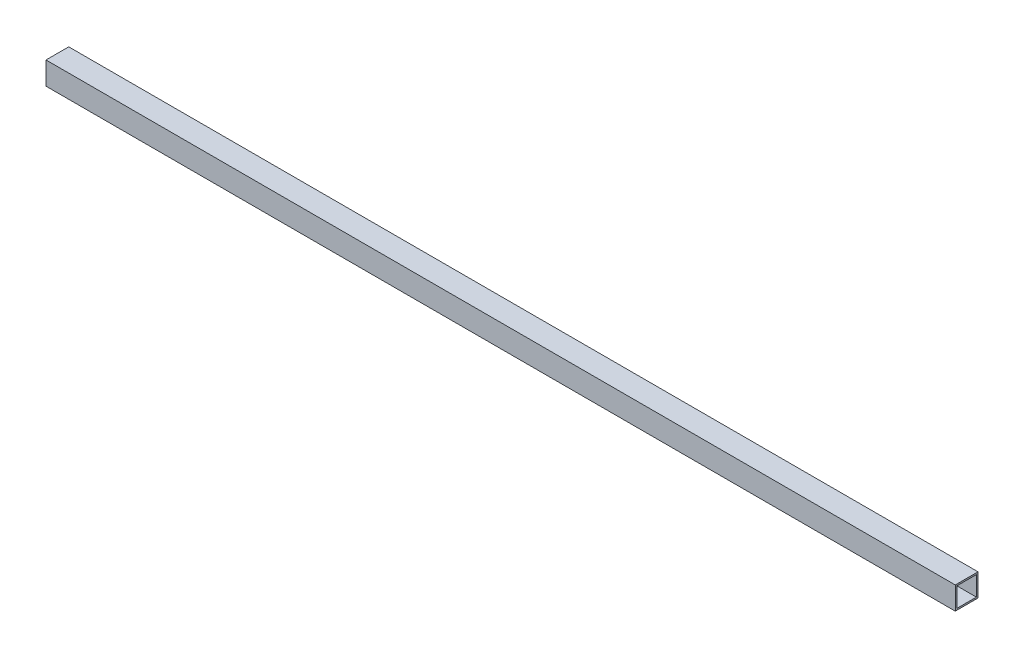
ISO-10303-21;
HEADER;
FILE_DESCRIPTION(('STEP AP214'),'2;1');
FILE_NAME('part.step','',(''),(''),'','','');
FILE_SCHEMA(('AUTOMOTIVE_DESIGN { 1 0 10303 214 1 1 1 1 }'));
ENDSEC;
DATA;
#1=APPLICATION_CONTEXT('core data for automotive mechanical design processes');
#2=APPLICATION_PROTOCOL_DEFINITION('international standard','automotive_design',2000,#1);
#3=PRODUCT_CONTEXT('',#1,'mechanical');
#4=PRODUCT('Part','Part','',(#3));
#5=PRODUCT_RELATED_PRODUCT_CATEGORY('part','',(#4));
#6=PRODUCT_DEFINITION_FORMATION('','',#4);
#7=PRODUCT_DEFINITION_CONTEXT('part definition',#1,'design');
#8=PRODUCT_DEFINITION('design','',#6,#7);
#9=PRODUCT_DEFINITION_SHAPE('','',#8);
#10=(LENGTH_UNIT() NAMED_UNIT(*) SI_UNIT(.MILLI.,.METRE.));
#11=(NAMED_UNIT(*) PLANE_ANGLE_UNIT() SI_UNIT($,.RADIAN.));
#12=(NAMED_UNIT(*) SI_UNIT($,.STERADIAN.) SOLID_ANGLE_UNIT());
#13=UNCERTAINTY_MEASURE_WITH_UNIT(LENGTH_MEASURE(1.E-05),#10,'distance_accuracy_value','');
#14=(GEOMETRIC_REPRESENTATION_CONTEXT(3) GLOBAL_UNCERTAINTY_ASSIGNED_CONTEXT((#13)) GLOBAL_UNIT_ASSIGNED_CONTEXT((#10,
#11,#12)) REPRESENTATION_CONTEXT('',''));
#15=CARTESIAN_POINT('',(0.,0.,0.));
#16=DIRECTION('',(0.,0.,1.));
#17=DIRECTION('',(1.,0.,0.));
#18=AXIS2_PLACEMENT_3D('',#15,#16,#17);
#19=CARTESIAN_POINT('',(889.,-22.225,22.225));
#20=DIRECTION('',(0.,-1.,0.));
#21=DIRECTION('',(0.,0.,-1.));
#22=AXIS2_PLACEMENT_3D('',#19,#20,#21);
#23=PLANE('',#22);
#24=DIRECTION('',(-1.,0.,0.));
#25=VECTOR('',#24,1.);
#26=CARTESIAN_POINT('',(889.,-22.225,-22.225));
#27=LINE('',#26,#25);
#28=CARTESIAN_POINT('',(889.,-22.225,-22.225));
#29=VERTEX_POINT('',#28);
#30=CARTESIAN_POINT('',(-889.,-22.225,-22.225));
#31=VERTEX_POINT('',#30);
#32=EDGE_CURVE('E89',#29,#31,#27,.T.);
#33=ORIENTED_EDGE('',*,*,#32,.F.);
#34=DIRECTION('',(0.,0.,-1.));
#35=VECTOR('',#34,1.);
#36=CARTESIAN_POINT('',(889.,-22.225,0.));
#37=LINE('',#36,#35);
#38=CARTESIAN_POINT('',(889.,-22.225,22.225));
#39=VERTEX_POINT('',#38);
#40=EDGE_CURVE('E134',#39,#29,#37,.T.);
#41=ORIENTED_EDGE('',*,*,#40,.F.);
#42=DIRECTION('',(1.,0.,0.));
#43=VECTOR('',#42,1.);
#44=CARTESIAN_POINT('',(889.,-22.225,22.225));
#45=LINE('',#44,#43);
#46=CARTESIAN_POINT('',(-889.,-22.225,22.225));
#47=VERTEX_POINT('',#46);
#48=EDGE_CURVE('E141',#47,#39,#45,.T.);
#49=ORIENTED_EDGE('',*,*,#48,.F.);
#50=DIRECTION('',(0.,0.,-1.));
#51=VECTOR('',#50,1.);
#52=CARTESIAN_POINT('',(-889.,-22.225,0.));
#53=LINE('',#52,#51);
#54=EDGE_CURVE('E110',#47,#31,#53,.T.);
#55=ORIENTED_EDGE('',*,*,#54,.T.);
#56=EDGE_LOOP('',(#33,#41,#49,#55));
#57=FACE_BOUND('',#56,.T.);
#58=ADVANCED_FACE('F17',(#57),#23,.T.);
#59=CARTESIAN_POINT('',(889.,-19.05,-19.05));
#60=DIRECTION('',(0.,1.,0.));
#61=DIRECTION('',(0.,0.,1.));
#62=AXIS2_PLACEMENT_3D('',#59,#60,#61);
#63=PLANE('',#62);
#64=DIRECTION('',(-1.,0.,0.));
#65=VECTOR('',#64,1.);
#66=CARTESIAN_POINT('',(889.,-19.05,19.05));
#67=LINE('',#66,#65);
#68=CARTESIAN_POINT('',(889.,-19.05,19.05));
#69=VERTEX_POINT('',#68);
#70=CARTESIAN_POINT('',(-889.,-19.05,19.05));
#71=VERTEX_POINT('',#70);
#72=EDGE_CURVE('E20',#69,#71,#67,.T.);
#73=ORIENTED_EDGE('',*,*,#72,.F.);
#74=DIRECTION('',(0.,0.,-1.));
#75=VECTOR('',#74,1.);
#76=CARTESIAN_POINT('',(889.,-19.05,0.));
#77=LINE('',#76,#75);
#78=CARTESIAN_POINT('',(889.,-19.05,-19.05));
#79=VERTEX_POINT('',#78);
#80=EDGE_CURVE('E85',#79,#69,#77,.F.);
#81=ORIENTED_EDGE('',*,*,#80,.F.);
#82=DIRECTION('',(1.,0.,0.));
#83=VECTOR('',#82,1.);
#84=CARTESIAN_POINT('',(889.,-19.05,-19.05));
#85=LINE('',#84,#83);
#86=CARTESIAN_POINT('',(-889.,-19.05,-19.05));
#87=VERTEX_POINT('',#86);
#88=EDGE_CURVE('E78',#87,#79,#85,.T.);
#89=ORIENTED_EDGE('',*,*,#88,.F.);
#90=DIRECTION('',(0.,0.,-1.));
#91=VECTOR('',#90,1.);
#92=CARTESIAN_POINT('',(-889.,-19.05,0.));
#93=LINE('',#92,#91);
#94=EDGE_CURVE('E82',#87,#71,#93,.F.);
#95=ORIENTED_EDGE('',*,*,#94,.T.);
#96=EDGE_LOOP('',(#73,#81,#89,#95));
#97=FACE_BOUND('',#96,.T.);
#98=ADVANCED_FACE('F80',(#97),#63,.T.);
#99=CARTESIAN_POINT('',(889.,-19.05,19.05));
#100=DIRECTION('',(0.,0.,-1.));
#101=DIRECTION('',(-1.,0.,0.));
#102=AXIS2_PLACEMENT_3D('',#99,#100,#101);
#103=PLANE('',#102);
#104=DIRECTION('',(1.,0.,0.));
#105=VECTOR('',#104,1.);
#106=CARTESIAN_POINT('',(889.,19.05,19.05));
#107=LINE('',#106,#105);
#108=CARTESIAN_POINT('',(889.,19.05,19.05));
#109=VERTEX_POINT('',#108);
#110=CARTESIAN_POINT('',(-889.,19.05,19.05));
#111=VERTEX_POINT('',#110);
#112=EDGE_CURVE('E115',#109,#111,#107,.F.);
#113=ORIENTED_EDGE('',*,*,#112,.F.);
#114=DIRECTION('',(0.,1.,0.));
#115=VECTOR('',#114,1.);
#116=CARTESIAN_POINT('',(889.,0.,19.05));
#117=LINE('',#116,#115);
#118=EDGE_CURVE('E123',#69,#109,#117,.T.);
#119=ORIENTED_EDGE('',*,*,#118,.F.);
#120=ORIENTED_EDGE('',*,*,#72,.T.);
#121=DIRECTION('',(0.,1.,0.));
#122=VECTOR('',#121,1.);
#123=CARTESIAN_POINT('',(-889.,0.,19.05));
#124=LINE('',#123,#122);
#125=EDGE_CURVE('E103',#71,#111,#124,.T.);
#126=ORIENTED_EDGE('',*,*,#125,.T.);
#127=EDGE_LOOP('',(#113,#119,#120,#126));
#128=FACE_BOUND('',#127,.T.);
#129=ADVANCED_FACE('F121',(#128),#103,.T.);
#130=CARTESIAN_POINT('',(889.,19.05,19.05));
#131=DIRECTION('',(0.,-1.,0.));
#132=DIRECTION('',(0.,0.,-1.));
#133=AXIS2_PLACEMENT_3D('',#130,#131,#132);
#134=PLANE('',#133);
#135=DIRECTION('',(1.,0.,0.));
#136=VECTOR('',#135,1.);
#137=CARTESIAN_POINT('',(889.,19.05,-19.05));
#138=LINE('',#137,#136);
#139=CARTESIAN_POINT('',(889.,19.05,-19.05));
#140=VERTEX_POINT('',#139);
#141=CARTESIAN_POINT('',(-889.,19.05,-19.05));
#142=VERTEX_POINT('',#141);
#143=EDGE_CURVE('E90',#140,#142,#138,.F.);
#144=ORIENTED_EDGE('',*,*,#143,.F.);
#145=DIRECTION('',(0.,0.,-1.));
#146=VECTOR('',#145,1.);
#147=CARTESIAN_POINT('',(889.,19.05,0.));
#148=LINE('',#147,#146);
#149=EDGE_CURVE('E126',#109,#140,#148,.T.);
#150=ORIENTED_EDGE('',*,*,#149,.F.);
#151=ORIENTED_EDGE('',*,*,#112,.T.);
#152=DIRECTION('',(0.,0.,-1.));
#153=VECTOR('',#152,1.);
#154=CARTESIAN_POINT('',(-889.,19.05,0.));
#155=LINE('',#154,#153);
#156=EDGE_CURVE('E105',#111,#142,#155,.T.);
#157=ORIENTED_EDGE('',*,*,#156,.T.);
#158=EDGE_LOOP('',(#144,#150,#151,#157));
#159=FACE_BOUND('',#158,.T.);
#160=ADVANCED_FACE('F145',(#159),#134,.T.);
#161=CARTESIAN_POINT('',(889.,19.05,-19.05));
#162=DIRECTION('',(0.,0.,1.));
#163=DIRECTION('',(1.,0.,0.));
#164=AXIS2_PLACEMENT_3D('',#161,#162,#163);
#165=PLANE('',#164);
#166=ORIENTED_EDGE('',*,*,#88,.T.);
#167=DIRECTION('',(0.,1.,0.));
#168=VECTOR('',#167,1.);
#169=CARTESIAN_POINT('',(889.,0.,-19.05));
#170=LINE('',#169,#168);
#171=EDGE_CURVE('E130',#140,#79,#170,.F.);
#172=ORIENTED_EDGE('',*,*,#171,.F.);
#173=ORIENTED_EDGE('',*,*,#143,.T.);
#174=DIRECTION('',(0.,1.,0.));
#175=VECTOR('',#174,1.);
#176=CARTESIAN_POINT('',(-889.,0.,-19.05));
#177=LINE('',#176,#175);
#178=EDGE_CURVE('E93',#142,#87,#177,.F.);
#179=ORIENTED_EDGE('',*,*,#178,.T.);
#180=EDGE_LOOP('',(#166,#172,#173,#179));
#181=FACE_BOUND('',#180,.T.);
#182=ADVANCED_FACE('F94',(#181),#165,.T.);
#183=CARTESIAN_POINT('',(889.,-22.225,-22.225));
#184=DIRECTION('',(0.,0.,-1.));
#185=DIRECTION('',(-1.,0.,0.));
#186=AXIS2_PLACEMENT_3D('',#183,#184,#185);
#187=PLANE('',#186);
#188=DIRECTION('',(1.,0.,0.));
#189=VECTOR('',#188,1.);
#190=CARTESIAN_POINT('',(889.,22.225,-22.225));
#191=LINE('',#190,#189);
#192=CARTESIAN_POINT('',(889.,22.225,-22.225));
#193=VERTEX_POINT('',#192);
#194=CARTESIAN_POINT('',(-889.,22.225,-22.225));
#195=VERTEX_POINT('',#194);
#196=EDGE_CURVE('E146',#193,#195,#191,.F.);
#197=ORIENTED_EDGE('',*,*,#196,.F.);
#198=DIRECTION('',(0.,1.,0.));
#199=VECTOR('',#198,1.);
#200=CARTESIAN_POINT('',(889.,0.,-22.225));
#201=LINE('',#200,#199);
#202=EDGE_CURVE('E131',#29,#193,#201,.T.);
#203=ORIENTED_EDGE('',*,*,#202,.F.);
#204=ORIENTED_EDGE('',*,*,#32,.T.);
#205=DIRECTION('',(0.,1.,0.));
#206=VECTOR('',#205,1.);
#207=CARTESIAN_POINT('',(-889.,0.,-22.225));
#208=LINE('',#207,#206);
#209=EDGE_CURVE('E98',#31,#195,#208,.T.);
#210=ORIENTED_EDGE('',*,*,#209,.T.);
#211=EDGE_LOOP('',(#197,#203,#204,#210));
#212=FACE_BOUND('',#211,.T.);
#213=ADVANCED_FACE('F165',(#212),#187,.T.);
#214=CARTESIAN_POINT('',(-889.,0.,0.));
#215=DIRECTION('',(1.,0.,0.));
#216=DIRECTION('',(0.,0.,-1.));
#217=AXIS2_PLACEMENT_3D('',#214,#215,#216);
#218=PLANE('',#217);
#219=ORIENTED_EDGE('',*,*,#125,.F.);
#220=ORIENTED_EDGE('',*,*,#94,.F.);
#221=ORIENTED_EDGE('',*,*,#178,.F.);
#222=ORIENTED_EDGE('',*,*,#156,.F.);
#223=EDGE_LOOP('',(#219,#220,#221,#222));
#224=FACE_BOUND('',#223,.T.);
#225=ORIENTED_EDGE('',*,*,#54,.F.);
#226=DIRECTION('',(0.,1.,0.));
#227=VECTOR('',#226,1.);
#228=CARTESIAN_POINT('',(-889.,22.225,22.225));
#229=LINE('',#228,#227);
#230=CARTESIAN_POINT('',(-889.,22.225,22.225));
#231=VERTEX_POINT('',#230);
#232=EDGE_CURVE('E143',#231,#47,#229,.F.);
#233=ORIENTED_EDGE('',*,*,#232,.F.);
#234=DIRECTION('',(0.,0.,1.));
#235=VECTOR('',#234,1.);
#236=CARTESIAN_POINT('',(-889.,22.225,-22.225));
#237=LINE('',#236,#235);
#238=EDGE_CURVE('E151',#195,#231,#237,.T.);
#239=ORIENTED_EDGE('',*,*,#238,.F.);
#240=ORIENTED_EDGE('',*,*,#209,.F.);
#241=EDGE_LOOP('',(#225,#233,#239,#240));
#242=FACE_BOUND('',#241,.T.);
#243=ADVANCED_FACE('F101',(#224,#242),#218,.F.);
#244=CARTESIAN_POINT('',(889.,22.225,22.225));
#245=DIRECTION('',(0.,0.,1.));
#246=DIRECTION('',(1.,0.,0.));
#247=AXIS2_PLACEMENT_3D('',#244,#245,#246);
#248=PLANE('',#247);
#249=ORIENTED_EDGE('',*,*,#48,.T.);
#250=DIRECTION('',(0.,1.,0.));
#251=VECTOR('',#250,1.);
#252=CARTESIAN_POINT('',(889.,0.,22.225));
#253=LINE('',#252,#251);
#254=CARTESIAN_POINT('',(889.,22.225,22.225));
#255=VERTEX_POINT('',#254);
#256=EDGE_CURVE('E35',#255,#39,#253,.F.);
#257=ORIENTED_EDGE('',*,*,#256,.F.);
#258=DIRECTION('',(1.,0.,0.));
#259=VECTOR('',#258,1.);
#260=CARTESIAN_POINT('',(889.,22.225,22.225));
#261=LINE('',#260,#259);
#262=EDGE_CURVE('E26',#231,#255,#261,.T.);
#263=ORIENTED_EDGE('',*,*,#262,.F.);
#264=ORIENTED_EDGE('',*,*,#232,.T.);
#265=EDGE_LOOP('',(#249,#257,#263,#264));
#266=FACE_BOUND('',#265,.T.);
#267=ADVANCED_FACE('F158',(#266),#248,.T.);
#268=CARTESIAN_POINT('',(889.,0.,0.));
#269=DIRECTION('',(1.,0.,0.));
#270=DIRECTION('',(0.,0.,-1.));
#271=AXIS2_PLACEMENT_3D('',#268,#269,#270);
#272=PLANE('',#271);
#273=ORIENTED_EDGE('',*,*,#149,.T.);
#274=ORIENTED_EDGE('',*,*,#171,.T.);
#275=ORIENTED_EDGE('',*,*,#80,.T.);
#276=ORIENTED_EDGE('',*,*,#118,.T.);
#277=EDGE_LOOP('',(#273,#274,#275,#276));
#278=FACE_BOUND('',#277,.T.);
#279=ORIENTED_EDGE('',*,*,#202,.T.);
#280=DIRECTION('',(0.,0.,1.));
#281=VECTOR('',#280,1.);
#282=CARTESIAN_POINT('',(889.,22.225,-22.225));
#283=LINE('',#282,#281);
#284=EDGE_CURVE('E11',#255,#193,#283,.F.);
#285=ORIENTED_EDGE('',*,*,#284,.F.);
#286=ORIENTED_EDGE('',*,*,#256,.T.);
#287=ORIENTED_EDGE('',*,*,#40,.T.);
#288=EDGE_LOOP('',(#279,#285,#286,#287));
#289=FACE_BOUND('',#288,.T.);
#290=ADVANCED_FACE('F128',(#278,#289),#272,.T.);
#291=CARTESIAN_POINT('',(889.,22.225,-22.225));
#292=DIRECTION('',(0.,1.,0.));
#293=DIRECTION('',(0.,0.,1.));
#294=AXIS2_PLACEMENT_3D('',#291,#292,#293);
#295=PLANE('',#294);
#296=ORIENTED_EDGE('',*,*,#262,.T.);
#297=ORIENTED_EDGE('',*,*,#284,.T.);
#298=ORIENTED_EDGE('',*,*,#196,.T.);
#299=ORIENTED_EDGE('',*,*,#238,.T.);
#300=EDGE_LOOP('',(#296,#297,#298,#299));
#301=FACE_BOUND('',#300,.T.);
#302=ADVANCED_FACE('F156',(#301),#295,.T.);
#303=CLOSED_SHELL('',(#58,#98,#129,#160,#182,#213,#243,#267,#290,#302));
#304=MANIFOLD_SOLID_BREP('B1',#303);
#305=ADVANCED_BREP_SHAPE_REPRESENTATION('',(#18,#304),#14);
#306=SHAPE_DEFINITION_REPRESENTATION(#9,#305);
ENDSEC;
END-ISO-10303-21;
